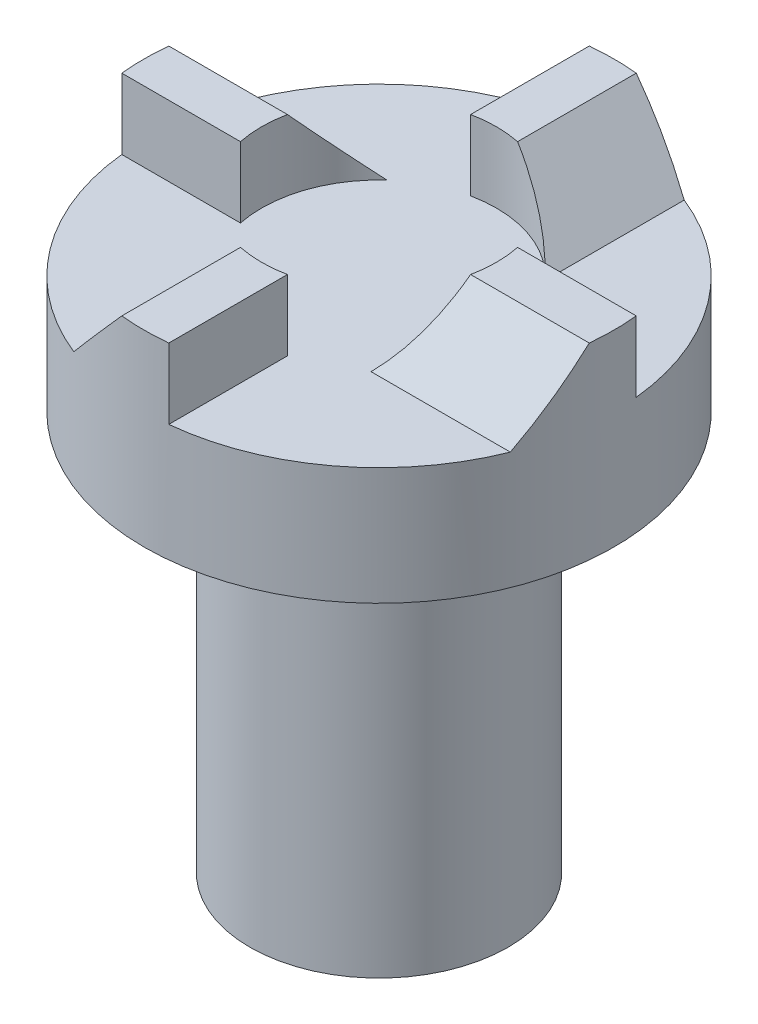
ISO-10303-21;
HEADER;
FILE_DESCRIPTION(('STEP AP214'),'2;1');
FILE_NAME('part.step','',(''),(''),'','','');
FILE_SCHEMA(('AUTOMOTIVE_DESIGN { 1 0 10303 214 1 1 1 1 }'));
ENDSEC;
DATA;
#1=APPLICATION_CONTEXT('core data for automotive mechanical design processes');
#2=APPLICATION_PROTOCOL_DEFINITION('international standard','automotive_design',2000,#1);
#3=PRODUCT_CONTEXT('',#1,'mechanical');
#4=PRODUCT('Part','Part','',(#3));
#5=PRODUCT_RELATED_PRODUCT_CATEGORY('part','',(#4));
#6=PRODUCT_DEFINITION_FORMATION('','',#4);
#7=PRODUCT_DEFINITION_CONTEXT('part definition',#1,'design');
#8=PRODUCT_DEFINITION('design','',#6,#7);
#9=PRODUCT_DEFINITION_SHAPE('','',#8);
#10=(LENGTH_UNIT() NAMED_UNIT(*) SI_UNIT(.MILLI.,.METRE.));
#11=(NAMED_UNIT(*) PLANE_ANGLE_UNIT() SI_UNIT($,.RADIAN.));
#12=(NAMED_UNIT(*) SI_UNIT($,.STERADIAN.) SOLID_ANGLE_UNIT());
#13=UNCERTAINTY_MEASURE_WITH_UNIT(LENGTH_MEASURE(1.E-05),#10,'distance_accuracy_value','');
#14=(GEOMETRIC_REPRESENTATION_CONTEXT(3) GLOBAL_UNCERTAINTY_ASSIGNED_CONTEXT((#13)) GLOBAL_UNIT_ASSIGNED_CONTEXT((#10,
#11,#12)) REPRESENTATION_CONTEXT('',''));
#15=CARTESIAN_POINT('',(0.,0.,0.));
#16=DIRECTION('',(0.,0.,1.));
#17=DIRECTION('',(1.,0.,0.));
#18=AXIS2_PLACEMENT_3D('',#15,#16,#17);
#19=CARTESIAN_POINT('',(0.,25.,0.));
#20=DIRECTION('',(0.,1.,0.));
#21=DIRECTION('',(0.,0.,1.));
#22=AXIS2_PLACEMENT_3D('',#19,#20,#21);
#23=PLANE('',#22);
#24=CARTESIAN_POINT('',(0.,25.,0.));
#25=DIRECTION('',(0.,1.,0.));
#26=DIRECTION('',(0.,0.,1.));
#27=AXIS2_PLACEMENT_3D('',#24,#25,#26);
#28=CIRCLE('',#27,5.);
#29=CARTESIAN_POINT('',(4.89897948556637,25.,0.999999999999951));
#30=VERTEX_POINT('',#29);
#31=CARTESIAN_POINT('',(4.89897948556636,25.,-1.));
#32=VERTEX_POINT('',#31);
#33=EDGE_CURVE('E185',#30,#32,#28,.T.);
#34=ORIENTED_EDGE('',*,*,#33,.F.);
#35=DIRECTION('',(1.,0.,0.));
#36=VECTOR('',#35,1.);
#37=CARTESIAN_POINT('',(4.89897948556636,25.,1.));
#38=LINE('',#37,#36);
#39=CARTESIAN_POINT('',(9.94987437106621,25.,1.));
#40=VERTEX_POINT('',#39);
#41=EDGE_CURVE('E226',#30,#40,#38,.T.);
#42=ORIENTED_EDGE('',*,*,#41,.T.);
#43=CARTESIAN_POINT('',(0.,25.,0.));
#44=DIRECTION('',(0.,1.,0.));
#45=DIRECTION('',(0.,0.,1.));
#46=AXIS2_PLACEMENT_3D('',#43,#44,#45);
#47=CIRCLE('',#46,10.);
#48=CARTESIAN_POINT('',(9.9498743710662,25.,-1.));
#49=VERTEX_POINT('',#48);
#50=EDGE_CURVE('E346',#40,#49,#47,.T.);
#51=ORIENTED_EDGE('',*,*,#50,.T.);
#52=DIRECTION('',(-1.,0.,0.));
#53=VECTOR('',#52,1.);
#54=CARTESIAN_POINT('',(4.89897948556636,25.,-1.));
#55=LINE('',#54,#53);
#56=EDGE_CURVE('E229',#49,#32,#55,.T.);
#57=ORIENTED_EDGE('',*,*,#56,.T.);
#58=EDGE_LOOP('',(#34,#42,#51,#57));
#59=FACE_BOUND('',#58,.T.);
#60=ADVANCED_FACE('F37',(#59),#23,.T.);
#61=CARTESIAN_POINT('',(1.,25.,-4.89897948556636));
#62=VERTEX_POINT('',#61);
#63=CARTESIAN_POINT('',(-1.,25.,-4.89897948556636));
#64=VERTEX_POINT('',#63);
#65=EDGE_CURVE('E332',#62,#64,#28,.T.);
#66=ORIENTED_EDGE('',*,*,#65,.F.);
#67=DIRECTION('',(0.,0.,-1.));
#68=VECTOR('',#67,1.);
#69=CARTESIAN_POINT('',(1.,25.,-10.));
#70=LINE('',#69,#68);
#71=CARTESIAN_POINT('',(1.,25.,-9.9498743710662));
#72=VERTEX_POINT('',#71);
#73=EDGE_CURVE('E232',#62,#72,#70,.T.);
#74=ORIENTED_EDGE('',*,*,#73,.T.);
#75=CARTESIAN_POINT('',(-1.,25.,-9.9498743710662));
#76=VERTEX_POINT('',#75);
#77=EDGE_CURVE('E60',#72,#76,#47,.T.);
#78=ORIENTED_EDGE('',*,*,#77,.T.);
#79=DIRECTION('',(0.,0.,1.));
#80=VECTOR('',#79,1.);
#81=CARTESIAN_POINT('',(-1.,25.,-10.));
#82=LINE('',#81,#80);
#83=EDGE_CURVE('E235',#76,#64,#82,.T.);
#84=ORIENTED_EDGE('',*,*,#83,.T.);
#85=EDGE_LOOP('',(#66,#74,#78,#84));
#86=FACE_BOUND('',#85,.T.);
#87=ADVANCED_FACE('F292',(#86),#23,.T.);
#88=CARTESIAN_POINT('',(-4.89897948556636,25.,-0.999999999999984));
#89=VERTEX_POINT('',#88);
#90=CARTESIAN_POINT('',(-4.89897948556636,25.,1.));
#91=VERTEX_POINT('',#90);
#92=EDGE_CURVE('E326',#89,#91,#28,.T.);
#93=ORIENTED_EDGE('',*,*,#92,.F.);
#94=DIRECTION('',(-1.,0.,0.));
#95=VECTOR('',#94,1.);
#96=CARTESIAN_POINT('',(-10.,25.,-1.));
#97=LINE('',#96,#95);
#98=CARTESIAN_POINT('',(-9.9498743710662,25.,-1.));
#99=VERTEX_POINT('',#98);
#100=EDGE_CURVE('E238',#89,#99,#97,.T.);
#101=ORIENTED_EDGE('',*,*,#100,.T.);
#102=CARTESIAN_POINT('',(-9.9498743710662,25.,1.));
#103=VERTEX_POINT('',#102);
#104=EDGE_CURVE('E379',#99,#103,#47,.T.);
#105=ORIENTED_EDGE('',*,*,#104,.T.);
#106=DIRECTION('',(1.,0.,0.));
#107=VECTOR('',#106,1.);
#108=CARTESIAN_POINT('',(-10.,25.,1.));
#109=LINE('',#108,#107);
#110=EDGE_CURVE('E241',#103,#91,#109,.T.);
#111=ORIENTED_EDGE('',*,*,#110,.T.);
#112=EDGE_LOOP('',(#93,#101,#105,#111));
#113=FACE_BOUND('',#112,.T.);
#114=ADVANCED_FACE('F299',(#113),#23,.T.);
#115=CARTESIAN_POINT('',(1.,25.,4.89897948556636));
#116=DIRECTION('',(-1.,0.,0.));
#117=DIRECTION('',(0.,0.,1.));
#118=AXIS2_PLACEMENT_3D('',#115,#116,#117);
#119=PLANE('',#118);
#120=DIRECTION('',(0.,1.,0.));
#121=VECTOR('',#120,1.);
#122=CARTESIAN_POINT('',(1.,0.,9.9498743710662));
#123=LINE('',#122,#121);
#124=CARTESIAN_POINT('',(1.,22.,9.9498743710662));
#125=VERTEX_POINT('',#124);
#126=CARTESIAN_POINT('',(1.,25.,9.9498743710662));
#127=VERTEX_POINT('',#126);
#128=EDGE_CURVE('E355',#125,#127,#123,.T.);
#129=ORIENTED_EDGE('',*,*,#128,.F.);
#130=DIRECTION('',(0.,0.,-1.));
#131=VECTOR('',#130,1.);
#132=CARTESIAN_POINT('',(1.,22.,4.89897948556636));
#133=LINE('',#132,#131);
#134=CARTESIAN_POINT('',(1.,22.,4.89897948556636));
#135=VERTEX_POINT('',#134);
#136=EDGE_CURVE('E245',#125,#135,#133,.T.);
#137=ORIENTED_EDGE('',*,*,#136,.T.);
#138=DIRECTION('',(0.,-1.,0.));
#139=VECTOR('',#138,1.);
#140=CARTESIAN_POINT('',(1.,25.,4.89897948556636));
#141=LINE('',#140,#139);
#142=CARTESIAN_POINT('',(1.,25.,4.89897948556636));
#143=VERTEX_POINT('',#142);
#144=EDGE_CURVE('E179',#143,#135,#141,.T.);
#145=ORIENTED_EDGE('',*,*,#144,.F.);
#146=DIRECTION('',(0.,0.,-1.));
#147=VECTOR('',#146,1.);
#148=CARTESIAN_POINT('',(1.,25.,4.89897948556636));
#149=LINE('',#148,#147);
#150=EDGE_CURVE('E223',#127,#143,#149,.T.);
#151=ORIENTED_EDGE('',*,*,#150,.F.);
#152=EDGE_LOOP('',(#129,#137,#145,#151));
#153=FACE_BOUND('',#152,.T.);
#154=ADVANCED_FACE('F317',(#153),#119,.F.);
#155=CARTESIAN_POINT('',(4.89897948556636,25.,-1.));
#156=DIRECTION('',(0.,0.,1.));
#157=DIRECTION('',(1.,0.,0.));
#158=AXIS2_PLACEMENT_3D('',#155,#156,#157);
#159=PLANE('',#158);
#160=DIRECTION('',(0.,1.,0.));
#161=VECTOR('',#160,1.);
#162=CARTESIAN_POINT('',(9.9498743710662,0.,-1.));
#163=LINE('',#162,#161);
#164=CARTESIAN_POINT('',(9.9498743710662,22.,-1.));
#165=VERTEX_POINT('',#164);
#166=EDGE_CURVE('E353',#165,#49,#163,.T.);
#167=ORIENTED_EDGE('',*,*,#166,.F.);
#168=DIRECTION('',(-1.,0.,0.));
#169=VECTOR('',#168,1.);
#170=CARTESIAN_POINT('',(4.89897948556636,22.,-1.));
#171=LINE('',#170,#169);
#172=CARTESIAN_POINT('',(4.89897948556636,22.,-1.));
#173=VERTEX_POINT('',#172);
#174=EDGE_CURVE('E247',#165,#173,#171,.T.);
#175=ORIENTED_EDGE('',*,*,#174,.T.);
#176=DIRECTION('',(0.,-1.,0.));
#177=VECTOR('',#176,1.);
#178=CARTESIAN_POINT('',(4.89897948556636,25.,-1.));
#179=LINE('',#178,#177);
#180=EDGE_CURVE('E262',#32,#173,#179,.T.);
#181=ORIENTED_EDGE('',*,*,#180,.F.);
#182=ORIENTED_EDGE('',*,*,#56,.F.);
#183=EDGE_LOOP('',(#167,#175,#181,#182));
#184=FACE_BOUND('',#183,.T.);
#185=ADVANCED_FACE('F322',(#184),#159,.F.);
#186=CARTESIAN_POINT('',(-1.,25.,-10.));
#187=DIRECTION('',(1.,0.,0.));
#188=DIRECTION('',(0.,0.,-1.));
#189=AXIS2_PLACEMENT_3D('',#186,#187,#188);
#190=PLANE('',#189);
#191=DIRECTION('',(0.,1.,0.));
#192=VECTOR('',#191,1.);
#193=CARTESIAN_POINT('',(-1.,0.,-9.9498743710662));
#194=LINE('',#193,#192);
#195=CARTESIAN_POINT('',(-1.,22.,-9.9498743710662));
#196=VERTEX_POINT('',#195);
#197=EDGE_CURVE('E351',#196,#76,#194,.T.);
#198=ORIENTED_EDGE('',*,*,#197,.F.);
#199=DIRECTION('',(0.,0.,1.));
#200=VECTOR('',#199,1.);
#201=CARTESIAN_POINT('',(-1.,22.,-10.));
#202=LINE('',#201,#200);
#203=CARTESIAN_POINT('',(-1.,22.,-4.89897948556636));
#204=VERTEX_POINT('',#203);
#205=EDGE_CURVE('E251',#196,#204,#202,.T.);
#206=ORIENTED_EDGE('',*,*,#205,.T.);
#207=DIRECTION('',(0.,-1.,0.));
#208=VECTOR('',#207,1.);
#209=CARTESIAN_POINT('',(-1.,25.,-4.89897948556636));
#210=LINE('',#209,#208);
#211=EDGE_CURVE('E260',#64,#204,#210,.T.);
#212=ORIENTED_EDGE('',*,*,#211,.F.);
#213=ORIENTED_EDGE('',*,*,#83,.F.);
#214=EDGE_LOOP('',(#198,#206,#212,#213));
#215=FACE_BOUND('',#214,.T.);
#216=ADVANCED_FACE('F314',(#215),#190,.F.);
#217=CARTESIAN_POINT('',(-10.,25.,1.));
#218=DIRECTION('',(0.,0.,-1.));
#219=DIRECTION('',(-1.,0.,0.));
#220=AXIS2_PLACEMENT_3D('',#217,#218,#219);
#221=PLANE('',#220);
#222=DIRECTION('',(0.,1.,0.));
#223=VECTOR('',#222,1.);
#224=CARTESIAN_POINT('',(-9.9498743710662,0.,1.));
#225=LINE('',#224,#223);
#226=CARTESIAN_POINT('',(-9.9498743710662,22.,1.));
#227=VERTEX_POINT('',#226);
#228=EDGE_CURVE('E344',#227,#103,#225,.T.);
#229=ORIENTED_EDGE('',*,*,#228,.F.);
#230=DIRECTION('',(1.,0.,0.));
#231=VECTOR('',#230,1.);
#232=CARTESIAN_POINT('',(-10.,22.,1.));
#233=LINE('',#232,#231);
#234=CARTESIAN_POINT('',(-4.89897948556636,22.,1.));
#235=VERTEX_POINT('',#234);
#236=EDGE_CURVE('E254',#227,#235,#233,.T.);
#237=ORIENTED_EDGE('',*,*,#236,.T.);
#238=DIRECTION('',(0.,-1.,0.));
#239=VECTOR('',#238,1.);
#240=CARTESIAN_POINT('',(-4.89897948556636,25.,1.));
#241=LINE('',#240,#239);
#242=EDGE_CURVE('E244',#91,#235,#241,.T.);
#243=ORIENTED_EDGE('',*,*,#242,.F.);
#244=ORIENTED_EDGE('',*,*,#110,.F.);
#245=EDGE_LOOP('',(#229,#237,#243,#244));
#246=FACE_BOUND('',#245,.T.);
#247=ADVANCED_FACE('F306',(#246),#221,.F.);
#248=CARTESIAN_POINT('',(-1.,25.,4.89897948556636));
#249=VERTEX_POINT('',#248);
#250=EDGE_CURVE('E333',#249,#143,#28,.T.);
#251=ORIENTED_EDGE('',*,*,#250,.F.);
#252=DIRECTION('',(0.,0.,1.));
#253=VECTOR('',#252,1.);
#254=CARTESIAN_POINT('',(-1.,25.,4.89897948556636));
#255=LINE('',#254,#253);
#256=CARTESIAN_POINT('',(-1.,25.,9.9498743710662));
#257=VERTEX_POINT('',#256);
#258=EDGE_CURVE('E196',#249,#257,#255,.T.);
#259=ORIENTED_EDGE('',*,*,#258,.T.);
#260=EDGE_CURVE('E409',#257,#127,#47,.T.);
#261=ORIENTED_EDGE('',*,*,#260,.T.);
#262=ORIENTED_EDGE('',*,*,#150,.T.);
#263=EDGE_LOOP('',(#251,#259,#261,#262));
#264=FACE_BOUND('',#263,.T.);
#265=ADVANCED_FACE('F295',(#264),#23,.T.);
#266=CARTESIAN_POINT('',(1.,25.,10.002));
#267=DIRECTION('',(0.743144825477391,0.669130606358862,0.));
#268=DIRECTION('',(-0.669130606358862,0.743144825477391,0.));
#269=AXIS2_PLACEMENT_3D('',#266,#267,#268);
#270=PLANE('',#269);
#271=DIRECTION('',(0.,0.,-1.));
#272=VECTOR('',#271,1.);
#273=CARTESIAN_POINT('',(3.70121213289355,22.,10.002));
#274=LINE('',#273,#272);
#275=CARTESIAN_POINT('',(3.70121213289355,22.,-3.36170027624736));
#276=VERTEX_POINT('',#275);
#277=CARTESIAN_POINT('',(3.70121213289355,22.,-9.28983469967693));
#278=VERTEX_POINT('',#277);
#279=EDGE_CURVE('E216',#276,#278,#274,.T.);
#280=ORIENTED_EDGE('',*,*,#279,.T.);
#281=CARTESIAN_POINT('',(0.,26.1106125148292,0.));
#282=DIRECTION('',(0.743144825477391,0.669130606358862,0.));
#283=DIRECTION('',(-0.669130606358862,0.743144825477391,0.));
#284=AXIS2_PLACEMENT_3D('',#281,#282,#283);
#285=ELLIPSE('',#284,14.944765498646,10.);
#286=EDGE_CURVE('E341',#278,#72,#285,.T.);
#287=ORIENTED_EDGE('',*,*,#286,.T.);
#288=ORIENTED_EDGE('',*,*,#73,.F.);
#289=CARTESIAN_POINT('',(0.,26.1106125148292,0.));
#290=DIRECTION('',(0.743144825477391,0.669130606358862,0.));
#291=DIRECTION('',(0.669130606358862,-0.743144825477391,0.));
#292=AXIS2_PLACEMENT_3D('',#289,#290,#291);
#293=ELLIPSE('',#292,7.472382749323,5.);
#294=EDGE_CURVE('E219',#62,#276,#293,.F.);
#295=ORIENTED_EDGE('',*,*,#294,.T.);
#296=EDGE_LOOP('',(#280,#287,#288,#295));
#297=FACE_BOUND('',#296,.T.);
#298=ADVANCED_FACE('F305',(#297),#270,.T.);
#299=CARTESIAN_POINT('',(10.002,25.,-1.00000000000003));
#300=DIRECTION('',(0.,0.669130606358862,-0.743144825477391));
#301=DIRECTION('',(0.,0.743144825477391,0.669130606358862));
#302=AXIS2_PLACEMENT_3D('',#299,#300,#301);
#303=PLANE('',#302);
#304=DIRECTION('',(-1.,0.,0.));
#305=VECTOR('',#304,1.);
#306=CARTESIAN_POINT('',(10.002,22.,-3.70121213289358));
#307=LINE('',#306,#305);
#308=CARTESIAN_POINT('',(-3.36170027624738,22.,-3.70121213289353));
#309=VERTEX_POINT('',#308);
#310=CARTESIAN_POINT('',(-9.28983469967694,22.,-3.70121213289351));
#311=VERTEX_POINT('',#310);
#312=EDGE_CURVE('E197',#309,#311,#307,.T.);
#313=ORIENTED_EDGE('',*,*,#312,.T.);
#314=CARTESIAN_POINT('',(0.,26.1106125148292,0.));
#315=DIRECTION('',(0.,0.669130606358862,-0.743144825477391));
#316=DIRECTION('',(0.,0.743144825477391,0.669130606358862));
#317=AXIS2_PLACEMENT_3D('',#314,#315,#316);
#318=ELLIPSE('',#317,14.944765498646,10.);
#319=EDGE_CURVE('E338',#311,#99,#318,.T.);
#320=ORIENTED_EDGE('',*,*,#319,.T.);
#321=ORIENTED_EDGE('',*,*,#100,.F.);
#322=CARTESIAN_POINT('',(0.,26.1106125148292,0.));
#323=DIRECTION('',(0.,0.669130606358862,-0.743144825477391));
#324=DIRECTION('',(0.,-0.743144825477391,-0.669130606358862));
#325=AXIS2_PLACEMENT_3D('',#322,#323,#324);
#326=ELLIPSE('',#325,7.472382749323,5.);
#327=EDGE_CURVE('E213',#89,#309,#326,.F.);
#328=ORIENTED_EDGE('',*,*,#327,.T.);
#329=EDGE_LOOP('',(#313,#320,#321,#328));
#330=FACE_BOUND('',#329,.T.);
#331=ADVANCED_FACE('F312',(#330),#303,.T.);
#332=CARTESIAN_POINT('',(-1.,25.,-10.002));
#333=DIRECTION('',(-0.743144825477391,0.669130606358862,0.));
#334=DIRECTION('',(-0.669130606358862,-0.743144825477391,0.));
#335=AXIS2_PLACEMENT_3D('',#332,#333,#334);
#336=PLANE('',#335);
#337=DIRECTION('',(0.,0.,1.));
#338=VECTOR('',#337,1.);
#339=CARTESIAN_POINT('',(-3.70121213289355,22.,-10.002));
#340=LINE('',#339,#338);
#341=CARTESIAN_POINT('',(-3.70121213289355,22.,3.36170027624736));
#342=VERTEX_POINT('',#341);
#343=CARTESIAN_POINT('',(-3.70121213289355,22.,9.28983469967693));
#344=VERTEX_POINT('',#343);
#345=EDGE_CURVE('E193',#342,#344,#340,.T.);
#346=ORIENTED_EDGE('',*,*,#345,.T.);
#347=CARTESIAN_POINT('',(0.,26.1106125148292,0.));
#348=DIRECTION('',(-0.743144825477391,0.669130606358862,0.));
#349=DIRECTION('',(0.669130606358862,0.743144825477391,0.));
#350=AXIS2_PLACEMENT_3D('',#347,#348,#349);
#351=ELLIPSE('',#350,14.944765498646,10.);
#352=EDGE_CURVE('E342',#344,#257,#351,.T.);
#353=ORIENTED_EDGE('',*,*,#352,.T.);
#354=ORIENTED_EDGE('',*,*,#258,.F.);
#355=CARTESIAN_POINT('',(0.,26.1106125148292,0.));
#356=DIRECTION('',(-0.743144825477391,0.669130606358862,0.));
#357=DIRECTION('',(-0.669130606358862,-0.743144825477391,0.));
#358=AXIS2_PLACEMENT_3D('',#355,#356,#357);
#359=ELLIPSE('',#358,7.472382749323,5.);
#360=EDGE_CURVE('E176',#249,#342,#359,.F.);
#361=ORIENTED_EDGE('',*,*,#360,.T.);
#362=EDGE_LOOP('',(#346,#353,#354,#361));
#363=FACE_BOUND('',#362,.T.);
#364=ADVANCED_FACE('F191',(#363),#336,.T.);
#365=CARTESIAN_POINT('',(-10.002,25.,1.0000000000001));
#366=DIRECTION('',(0.,0.669130606358862,0.743144825477391));
#367=DIRECTION('',(0.,-0.743144825477391,0.669130606358862));
#368=AXIS2_PLACEMENT_3D('',#365,#366,#367);
#369=PLANE('',#368);
#370=DIRECTION('',(1.,0.,0.));
#371=VECTOR('',#370,1.);
#372=CARTESIAN_POINT('',(-10.002,22.,3.70121213289365));
#373=LINE('',#372,#371);
#374=CARTESIAN_POINT('',(3.3617002762474,22.,3.70121213289351));
#375=VERTEX_POINT('',#374);
#376=CARTESIAN_POINT('',(9.28983469967697,22.,3.70121213289345));
#377=VERTEX_POINT('',#376);
#378=EDGE_CURVE('E204',#375,#377,#373,.T.);
#379=ORIENTED_EDGE('',*,*,#378,.T.);
#380=CARTESIAN_POINT('',(0.,26.1106125148292,0.));
#381=DIRECTION('',(0.,0.669130606358862,0.743144825477391));
#382=DIRECTION('',(0.,0.743144825477391,-0.669130606358862));
#383=AXIS2_PLACEMENT_3D('',#380,#381,#382);
#384=ELLIPSE('',#383,14.944765498646,10.);
#385=EDGE_CURVE('E257',#377,#40,#384,.T.);
#386=ORIENTED_EDGE('',*,*,#385,.T.);
#387=ORIENTED_EDGE('',*,*,#41,.F.);
#388=CARTESIAN_POINT('',(0.,26.1106125148292,0.));
#389=DIRECTION('',(0.,0.669130606358862,0.743144825477391));
#390=DIRECTION('',(0.,-0.743144825477391,0.669130606358862));
#391=AXIS2_PLACEMENT_3D('',#388,#389,#390);
#392=ELLIPSE('',#391,7.472382749323,5.);
#393=EDGE_CURVE('E207',#30,#375,#392,.F.);
#394=ORIENTED_EDGE('',*,*,#393,.T.);
#395=EDGE_LOOP('',(#379,#386,#387,#394));
#396=FACE_BOUND('',#395,.T.);
#397=ADVANCED_FACE('F360',(#396),#369,.T.);
#398=CARTESIAN_POINT('',(0.,17.,0.));
#399=DIRECTION('',(0.,-1.,0.));
#400=DIRECTION('',(0.,0.,-1.));
#401=AXIS2_PLACEMENT_3D('',#398,#399,#400);
#402=CYLINDRICAL_SURFACE('',#401,5.5);
#403=CARTESIAN_POINT('',(0.,15.,0.));
#404=DIRECTION('',(0.,1.,0.));
#405=DIRECTION('',(0.,0.,1.));
#406=AXIS2_PLACEMENT_3D('',#403,#404,#405);
#407=CIRCLE('',#406,5.5);
#408=CARTESIAN_POINT('',(0.,15.,5.5));
#409=VERTEX_POINT('',#408);
#410=EDGE_CURVE('E11',#409,#409,#407,.F.);
#411=ORIENTED_EDGE('',*,*,#410,.T.);
#412=EDGE_LOOP('',(#411));
#413=FACE_BOUND('',#412,.T.);
#414=CARTESIAN_POINT('',(0.,0.,0.));
#415=DIRECTION('',(0.,1.,0.));
#416=DIRECTION('',(0.,0.,1.));
#417=AXIS2_PLACEMENT_3D('',#414,#415,#416);
#418=CIRCLE('',#417,5.5);
#419=CARTESIAN_POINT('',(0.,0.,5.5));
#420=VERTEX_POINT('',#419);
#421=EDGE_CURVE('E248',#420,#420,#418,.T.);
#422=ORIENTED_EDGE('',*,*,#421,.T.);
#423=EDGE_LOOP('',(#422));
#424=FACE_BOUND('',#423,.T.);
#425=ADVANCED_FACE('F450',(#413,#424),#402,.T.);
#426=CARTESIAN_POINT('',(0.,0.,0.));
#427=DIRECTION('',(0.,1.,0.));
#428=DIRECTION('',(0.,0.,1.));
#429=AXIS2_PLACEMENT_3D('',#426,#427,#428);
#430=PLANE('',#429);
#431=DIRECTION('',(0.,0.,-1.));
#432=VECTOR('',#431,1.);
#433=CARTESIAN_POINT('',(-1.65018112642219,0.,-2.0735));
#434=LINE('',#433,#432);
#435=CARTESIAN_POINT('',(-1.65018112642219,0.,2.0735));
#436=VERTEX_POINT('',#435);
#437=CARTESIAN_POINT('',(-1.65018112642219,0.,-2.0735));
#438=VERTEX_POINT('',#437);
#439=EDGE_CURVE('E399',#436,#438,#434,.T.);
#440=ORIENTED_EDGE('',*,*,#439,.F.);
#441=CARTESIAN_POINT('',(0.,0.,0.));
#442=DIRECTION('',(0.,-1.,0.));
#443=DIRECTION('',(0.,0.,-1.));
#444=AXIS2_PLACEMENT_3D('',#441,#442,#443);
#445=CIRCLE('',#444,2.65);
#446=CARTESIAN_POINT('',(1.65018112642219,0.,2.0735));
#447=VERTEX_POINT('',#446);
#448=EDGE_CURVE('E52',#447,#436,#445,.T.);
#449=ORIENTED_EDGE('',*,*,#448,.F.);
#450=DIRECTION('',(0.,0.,1.));
#451=VECTOR('',#450,1.);
#452=CARTESIAN_POINT('',(1.65018112642219,0.,-2.0735));
#453=LINE('',#452,#451);
#454=CARTESIAN_POINT('',(1.65018112642219,0.,-2.0735));
#455=VERTEX_POINT('',#454);
#456=EDGE_CURVE('E388',#455,#447,#453,.T.);
#457=ORIENTED_EDGE('',*,*,#456,.F.);
#458=CARTESIAN_POINT('',(0.,0.,0.));
#459=DIRECTION('',(0.,-1.,0.));
#460=DIRECTION('',(0.,0.,-1.));
#461=AXIS2_PLACEMENT_3D('',#458,#459,#460);
#462=CIRCLE('',#461,2.65);
#463=EDGE_CURVE('E402',#438,#455,#462,.T.);
#464=ORIENTED_EDGE('',*,*,#463,.F.);
#465=EDGE_LOOP('',(#440,#449,#457,#464));
#466=FACE_BOUND('',#465,.T.);
#467=ORIENTED_EDGE('',*,*,#421,.F.);
#468=EDGE_LOOP('',(#467));
#469=FACE_BOUND('',#468,.T.);
#470=ADVANCED_FACE('F473',(#466,#469),#430,.F.);
#471=CARTESIAN_POINT('',(0.,22.,0.));
#472=DIRECTION('',(0.,-1.,0.));
#473=DIRECTION('',(0.,0.,-1.));
#474=AXIS2_PLACEMENT_3D('',#471,#472,#473);
#475=CYLINDRICAL_SURFACE('',#474,10.);
#476=CARTESIAN_POINT('',(0.,22.,0.));
#477=DIRECTION('',(0.,1.,0.));
#478=DIRECTION('',(0.,0.,1.));
#479=AXIS2_PLACEMENT_3D('',#476,#477,#478);
#480=CIRCLE('',#479,10.);
#481=EDGE_CURVE('E268',#125,#377,#480,.T.);
#482=ORIENTED_EDGE('',*,*,#481,.F.);
#483=ORIENTED_EDGE('',*,*,#128,.T.);
#484=ORIENTED_EDGE('',*,*,#260,.F.);
#485=ORIENTED_EDGE('',*,*,#352,.F.);
#486=EDGE_CURVE('E203',#227,#344,#480,.T.);
#487=ORIENTED_EDGE('',*,*,#486,.F.);
#488=ORIENTED_EDGE('',*,*,#228,.T.);
#489=ORIENTED_EDGE('',*,*,#104,.F.);
#490=ORIENTED_EDGE('',*,*,#319,.F.);
#491=EDGE_CURVE('E267',#196,#311,#480,.T.);
#492=ORIENTED_EDGE('',*,*,#491,.F.);
#493=ORIENTED_EDGE('',*,*,#197,.T.);
#494=ORIENTED_EDGE('',*,*,#77,.F.);
#495=ORIENTED_EDGE('',*,*,#286,.F.);
#496=EDGE_CURVE('E366',#165,#278,#480,.T.);
#497=ORIENTED_EDGE('',*,*,#496,.F.);
#498=ORIENTED_EDGE('',*,*,#166,.T.);
#499=ORIENTED_EDGE('',*,*,#50,.F.);
#500=ORIENTED_EDGE('',*,*,#385,.F.);
#501=EDGE_LOOP('',(#482,#483,#484,#485,#487,#488,#489,#490,#492,#493,#494,#495,#497,#498,#499,#500));
#502=FACE_BOUND('',#501,.T.);
#503=CARTESIAN_POINT('',(0.,17.,0.));
#504=DIRECTION('',(0.,1.,0.));
#505=DIRECTION('',(0.,0.,1.));
#506=AXIS2_PLACEMENT_3D('',#503,#504,#505);
#507=CIRCLE('',#506,10.);
#508=CARTESIAN_POINT('',(0.,17.,10.));
#509=VERTEX_POINT('',#508);
#510=EDGE_CURVE('E265',#509,#509,#507,.T.);
#511=ORIENTED_EDGE('',*,*,#510,.T.);
#512=EDGE_LOOP('',(#511));
#513=FACE_BOUND('',#512,.T.);
#514=ADVANCED_FACE('F372',(#502,#513),#475,.T.);
#515=CARTESIAN_POINT('',(0.,22.,0.));
#516=DIRECTION('',(0.,1.,0.));
#517=DIRECTION('',(0.,0.,1.));
#518=AXIS2_PLACEMENT_3D('',#515,#516,#517);
#519=PLANE('',#518);
#520=ORIENTED_EDGE('',*,*,#378,.F.);
#521=CARTESIAN_POINT('',(0.,22.,0.));
#522=DIRECTION('',(0.,1.,0.));
#523=DIRECTION('',(0.,0.,1.));
#524=AXIS2_PLACEMENT_3D('',#521,#522,#523);
#525=CIRCLE('',#524,5.);
#526=EDGE_CURVE('E184',#173,#375,#525,.F.);
#527=ORIENTED_EDGE('',*,*,#526,.F.);
#528=ORIENTED_EDGE('',*,*,#174,.F.);
#529=ORIENTED_EDGE('',*,*,#496,.T.);
#530=ORIENTED_EDGE('',*,*,#279,.F.);
#531=EDGE_CURVE('E382',#204,#276,#525,.F.);
#532=ORIENTED_EDGE('',*,*,#531,.F.);
#533=ORIENTED_EDGE('',*,*,#205,.F.);
#534=ORIENTED_EDGE('',*,*,#491,.T.);
#535=ORIENTED_EDGE('',*,*,#312,.F.);
#536=EDGE_CURVE('E187',#235,#309,#525,.F.);
#537=ORIENTED_EDGE('',*,*,#536,.F.);
#538=ORIENTED_EDGE('',*,*,#236,.F.);
#539=ORIENTED_EDGE('',*,*,#486,.T.);
#540=ORIENTED_EDGE('',*,*,#345,.F.);
#541=EDGE_CURVE('E173',#135,#342,#525,.F.);
#542=ORIENTED_EDGE('',*,*,#541,.F.);
#543=ORIENTED_EDGE('',*,*,#136,.F.);
#544=ORIENTED_EDGE('',*,*,#481,.T.);
#545=EDGE_LOOP('',(#520,#527,#528,#529,#530,#532,#533,#534,#535,#537,#538,#539,#540,#542,#543,#544));
#546=FACE_BOUND('',#545,.T.);
#547=ADVANCED_FACE('F200',(#546),#519,.T.);
#548=CARTESIAN_POINT('',(0.,17.,0.));
#549=DIRECTION('',(0.,1.,0.));
#550=DIRECTION('',(0.,0.,1.));
#551=AXIS2_PLACEMENT_3D('',#548,#549,#550);
#552=PLANE('',#551);
#553=CARTESIAN_POINT('',(0.,17.,0.));
#554=DIRECTION('',(0.,1.,0.));
#555=DIRECTION('',(0.,0.,1.));
#556=AXIS2_PLACEMENT_3D('',#553,#554,#555);
#557=CIRCLE('',#556,7.5);
#558=CARTESIAN_POINT('',(0.,17.,7.5));
#559=VERTEX_POINT('',#558);
#560=EDGE_CURVE('E45',#559,#559,#557,.T.);
#561=ORIENTED_EDGE('',*,*,#560,.T.);
#562=EDGE_LOOP('',(#561));
#563=FACE_BOUND('',#562,.T.);
#564=ORIENTED_EDGE('',*,*,#510,.F.);
#565=EDGE_LOOP('',(#564));
#566=FACE_BOUND('',#565,.T.);
#567=ADVANCED_FACE('F277',(#563,#566),#552,.F.);
#568=CARTESIAN_POINT('',(0.,15.,0.));
#569=DIRECTION('',(0.,1.,0.));
#570=DIRECTION('',(0.,0.,1.));
#571=AXIS2_PLACEMENT_3D('',#568,#569,#570);
#572=TOROIDAL_SURFACE('',#571,7.5,2.);
#573=ORIENTED_EDGE('',*,*,#410,.F.);
#574=EDGE_LOOP('',(#573));
#575=FACE_BOUND('',#574,.T.);
#576=ORIENTED_EDGE('',*,*,#560,.F.);
#577=EDGE_LOOP('',(#576));
#578=FACE_BOUND('',#577,.T.);
#579=ADVANCED_FACE('F39',(#575,#578),#572,.F.);
#580=CARTESIAN_POINT('',(0.,6.,0.));
#581=DIRECTION('',(0.,-1.,0.));
#582=DIRECTION('',(0.,0.,-1.));
#583=AXIS2_PLACEMENT_3D('',#580,#581,#582);
#584=CYLINDRICAL_SURFACE('',#583,2.65);
#585=ORIENTED_EDGE('',*,*,#448,.T.);
#586=DIRECTION('',(0.,-1.,0.));
#587=VECTOR('',#586,1.);
#588=CARTESIAN_POINT('',(-1.65018112642219,6.,2.0735));
#589=LINE('',#588,#587);
#590=CARTESIAN_POINT('',(-1.65018112642219,6.,2.0735));
#591=VERTEX_POINT('',#590);
#592=EDGE_CURVE('E397',#591,#436,#589,.T.);
#593=ORIENTED_EDGE('',*,*,#592,.F.);
#594=CARTESIAN_POINT('',(0.,6.,0.));
#595=DIRECTION('',(0.,-1.,0.));
#596=DIRECTION('',(0.,0.,-1.));
#597=AXIS2_PLACEMENT_3D('',#594,#595,#596);
#598=CIRCLE('',#597,2.65);
#599=CARTESIAN_POINT('',(1.65018112642219,6.,2.0735));
#600=VERTEX_POINT('',#599);
#601=EDGE_CURVE('E384',#600,#591,#598,.T.);
#602=ORIENTED_EDGE('',*,*,#601,.F.);
#603=DIRECTION('',(0.,-1.,0.));
#604=VECTOR('',#603,1.);
#605=CARTESIAN_POINT('',(1.65018112642219,6.,2.0735));
#606=LINE('',#605,#604);
#607=EDGE_CURVE('E407',#600,#447,#606,.T.);
#608=ORIENTED_EDGE('',*,*,#607,.T.);
#609=EDGE_LOOP('',(#585,#593,#602,#608));
#610=FACE_BOUND('',#609,.T.);
#611=ADVANCED_FACE('F281',(#610),#584,.F.);
#612=CARTESIAN_POINT('',(1.65018112642219,6.,-2.0735));
#613=DIRECTION('',(1.,0.,0.));
#614=DIRECTION('',(0.,0.,-1.));
#615=AXIS2_PLACEMENT_3D('',#612,#613,#614);
#616=PLANE('',#615);
#617=ORIENTED_EDGE('',*,*,#456,.T.);
#618=ORIENTED_EDGE('',*,*,#607,.F.);
#619=DIRECTION('',(0.,0.,1.));
#620=VECTOR('',#619,1.);
#621=CARTESIAN_POINT('',(1.65018112642219,6.,-2.0735));
#622=LINE('',#621,#620);
#623=CARTESIAN_POINT('',(1.65018112642219,6.,-2.0735));
#624=VERTEX_POINT('',#623);
#625=EDGE_CURVE('E394',#624,#600,#622,.T.);
#626=ORIENTED_EDGE('',*,*,#625,.F.);
#627=DIRECTION('',(0.,-1.,0.));
#628=VECTOR('',#627,1.);
#629=CARTESIAN_POINT('',(1.65018112642219,6.,-2.0735));
#630=LINE('',#629,#628);
#631=EDGE_CURVE('E410',#624,#455,#630,.T.);
#632=ORIENTED_EDGE('',*,*,#631,.T.);
#633=EDGE_LOOP('',(#617,#618,#626,#632));
#634=FACE_BOUND('',#633,.T.);
#635=ADVANCED_FACE('F287',(#634),#616,.F.);
#636=CARTESIAN_POINT('',(0.,6.,0.));
#637=DIRECTION('',(0.,-1.,0.));
#638=DIRECTION('',(0.,0.,-1.));
#639=AXIS2_PLACEMENT_3D('',#636,#637,#638);
#640=CYLINDRICAL_SURFACE('',#639,2.65);
#641=ORIENTED_EDGE('',*,*,#463,.T.);
#642=ORIENTED_EDGE('',*,*,#631,.F.);
#643=CARTESIAN_POINT('',(0.,6.,0.));
#644=DIRECTION('',(0.,-1.,0.));
#645=DIRECTION('',(0.,0.,-1.));
#646=AXIS2_PLACEMENT_3D('',#643,#644,#645);
#647=CIRCLE('',#646,2.65);
#648=CARTESIAN_POINT('',(-1.65018112642219,6.,-2.0735));
#649=VERTEX_POINT('',#648);
#650=EDGE_CURVE('E391',#649,#624,#647,.T.);
#651=ORIENTED_EDGE('',*,*,#650,.F.);
#652=DIRECTION('',(0.,-1.,0.));
#653=VECTOR('',#652,1.);
#654=CARTESIAN_POINT('',(-1.65018112642219,6.,-2.0735));
#655=LINE('',#654,#653);
#656=EDGE_CURVE('E412',#649,#438,#655,.T.);
#657=ORIENTED_EDGE('',*,*,#656,.T.);
#658=EDGE_LOOP('',(#641,#642,#651,#657));
#659=FACE_BOUND('',#658,.T.);
#660=ADVANCED_FACE('F438',(#659),#640,.F.);
#661=CARTESIAN_POINT('',(-1.65018112642219,6.,-2.0735));
#662=DIRECTION('',(-1.,0.,0.));
#663=DIRECTION('',(0.,0.,1.));
#664=AXIS2_PLACEMENT_3D('',#661,#662,#663);
#665=PLANE('',#664);
#666=ORIENTED_EDGE('',*,*,#439,.T.);
#667=ORIENTED_EDGE('',*,*,#656,.F.);
#668=DIRECTION('',(0.,0.,-1.));
#669=VECTOR('',#668,1.);
#670=CARTESIAN_POINT('',(-1.65018112642219,6.,-2.0735));
#671=LINE('',#670,#669);
#672=EDGE_CURVE('E387',#591,#649,#671,.T.);
#673=ORIENTED_EDGE('',*,*,#672,.F.);
#674=ORIENTED_EDGE('',*,*,#592,.T.);
#675=EDGE_LOOP('',(#666,#667,#673,#674));
#676=FACE_BOUND('',#675,.T.);
#677=ADVANCED_FACE('F433',(#676),#665,.F.);
#678=CARTESIAN_POINT('',(0.,6.,0.));
#679=DIRECTION('',(0.,-1.,0.));
#680=DIRECTION('',(0.,0.,-1.));
#681=AXIS2_PLACEMENT_3D('',#678,#679,#680);
#682=PLANE('',#681);
#683=ORIENTED_EDGE('',*,*,#601,.T.);
#684=ORIENTED_EDGE('',*,*,#672,.T.);
#685=ORIENTED_EDGE('',*,*,#650,.T.);
#686=ORIENTED_EDGE('',*,*,#625,.T.);
#687=EDGE_LOOP('',(#683,#684,#685,#686));
#688=FACE_BOUND('',#687,.T.);
#689=ADVANCED_FACE('F428',(#688),#682,.T.);
#690=CARTESIAN_POINT('',(0.,7.85786437626905,0.));
#691=DIRECTION('',(0.,1.,0.));
#692=DIRECTION('',(0.,0.,1.));
#693=AXIS2_PLACEMENT_3D('',#690,#691,#692);
#694=CYLINDRICAL_SURFACE('',#693,5.);
#695=ORIENTED_EDGE('',*,*,#541,.T.);
#696=ORIENTED_EDGE('',*,*,#360,.F.);
#697=ORIENTED_EDGE('',*,*,#250,.T.);
#698=ORIENTED_EDGE('',*,*,#144,.T.);
#699=EDGE_LOOP('',(#695,#696,#697,#698));
#700=FACE_BOUND('',#699,.T.);
#701=ADVANCED_FACE('F175',(#700),#694,.F.);
#702=ORIENTED_EDGE('',*,*,#526,.T.);
#703=ORIENTED_EDGE('',*,*,#393,.F.);
#704=ORIENTED_EDGE('',*,*,#33,.T.);
#705=ORIENTED_EDGE('',*,*,#180,.T.);
#706=EDGE_LOOP('',(#702,#703,#704,#705));
#707=FACE_BOUND('',#706,.T.);
#708=ADVANCED_FACE('F418',(#707),#694,.F.);
#709=ORIENTED_EDGE('',*,*,#531,.T.);
#710=ORIENTED_EDGE('',*,*,#294,.F.);
#711=ORIENTED_EDGE('',*,*,#65,.T.);
#712=ORIENTED_EDGE('',*,*,#211,.T.);
#713=EDGE_LOOP('',(#709,#710,#711,#712));
#714=FACE_BOUND('',#713,.T.);
#715=ADVANCED_FACE('F381',(#714),#694,.F.);
#716=ORIENTED_EDGE('',*,*,#536,.T.);
#717=ORIENTED_EDGE('',*,*,#327,.F.);
#718=ORIENTED_EDGE('',*,*,#92,.T.);
#719=ORIENTED_EDGE('',*,*,#242,.T.);
#720=EDGE_LOOP('',(#716,#717,#718,#719));
#721=FACE_BOUND('',#720,.T.);
#722=ADVANCED_FACE('F420',(#721),#694,.F.);
#723=CLOSED_SHELL('',(#60,#87,#114,#154,#185,#216,#247,#265,#298,#331,#364,#397,#425,#470,#514,
#547,#567,#579,#611,#635,#660,#677,#689,#701,#708,#715,#722));
#724=MANIFOLD_SOLID_BREP('B2',#723);
#725=ADVANCED_BREP_SHAPE_REPRESENTATION('',(#18,#724),#14);
#726=SHAPE_DEFINITION_REPRESENTATION(#9,#725);
ENDSEC;
END-ISO-10303-21;
